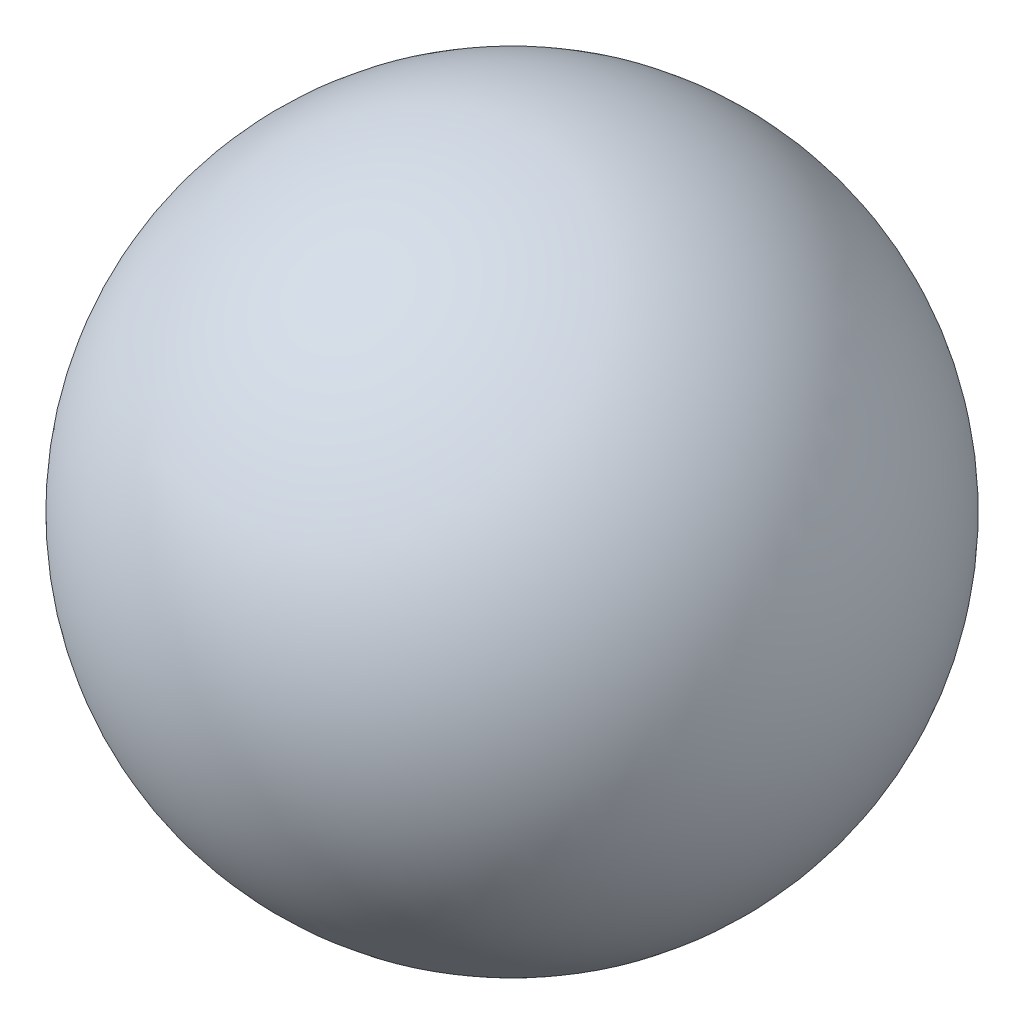
ISO-10303-21;
HEADER;
FILE_DESCRIPTION(('STEP AP214'),'2;1');
FILE_NAME('part.step','',(''),(''),'','','');
FILE_SCHEMA(('AUTOMOTIVE_DESIGN { 1 0 10303 214 1 1 1 1 }'));
ENDSEC;
DATA;
#1=APPLICATION_CONTEXT('core data for automotive mechanical design processes');
#2=APPLICATION_PROTOCOL_DEFINITION('international standard','automotive_design',2000,#1);
#3=PRODUCT_CONTEXT('',#1,'mechanical');
#4=PRODUCT('Part','Part','',(#3));
#5=PRODUCT_RELATED_PRODUCT_CATEGORY('part','',(#4));
#6=PRODUCT_DEFINITION_FORMATION('','',#4);
#7=PRODUCT_DEFINITION_CONTEXT('part definition',#1,'design');
#8=PRODUCT_DEFINITION('design','',#6,#7);
#9=PRODUCT_DEFINITION_SHAPE('','',#8);
#10=(LENGTH_UNIT() NAMED_UNIT(*) SI_UNIT(.MILLI.,.METRE.));
#11=(NAMED_UNIT(*) PLANE_ANGLE_UNIT() SI_UNIT($,.RADIAN.));
#12=(NAMED_UNIT(*) SI_UNIT($,.STERADIAN.) SOLID_ANGLE_UNIT());
#13=UNCERTAINTY_MEASURE_WITH_UNIT(LENGTH_MEASURE(1.E-05),#10,'distance_accuracy_value','');
#14=(GEOMETRIC_REPRESENTATION_CONTEXT(3) GLOBAL_UNCERTAINTY_ASSIGNED_CONTEXT((#13)) GLOBAL_UNIT_ASSIGNED_CONTEXT((#10,
#11,#12)) REPRESENTATION_CONTEXT('',''));
#15=CARTESIAN_POINT('',(0.,0.,0.));
#16=DIRECTION('',(0.,0.,1.));
#17=DIRECTION('',(1.,0.,0.));
#18=AXIS2_PLACEMENT_3D('',#15,#16,#17);
#19=CARTESIAN_POINT('',(0.,0.,0.));
#20=DIRECTION('',(0.,1.,0.));
#21=DIRECTION('',(1.,0.,0.));
#22=AXIS2_PLACEMENT_3D('',#19,#20,#21);
#23=SPHERICAL_SURFACE('',#22,1.65);
#24=CARTESIAN_POINT('',(0.,1.65,0.));
#25=VERTEX_POINT('',#24);
#26=VERTEX_LOOP('',#25);
#27=FACE_BOUND('',#26,.T.);
#28=ADVANCED_FACE('F29',(#27),#23,.T.);
#29=CLOSED_SHELL('',(#28));
#30=MANIFOLD_SOLID_BREP('B2',#29);
#31=ADVANCED_BREP_SHAPE_REPRESENTATION('',(#18,#30),#14);
#32=SHAPE_DEFINITION_REPRESENTATION(#9,#31);
ENDSEC;
END-ISO-10303-21;
